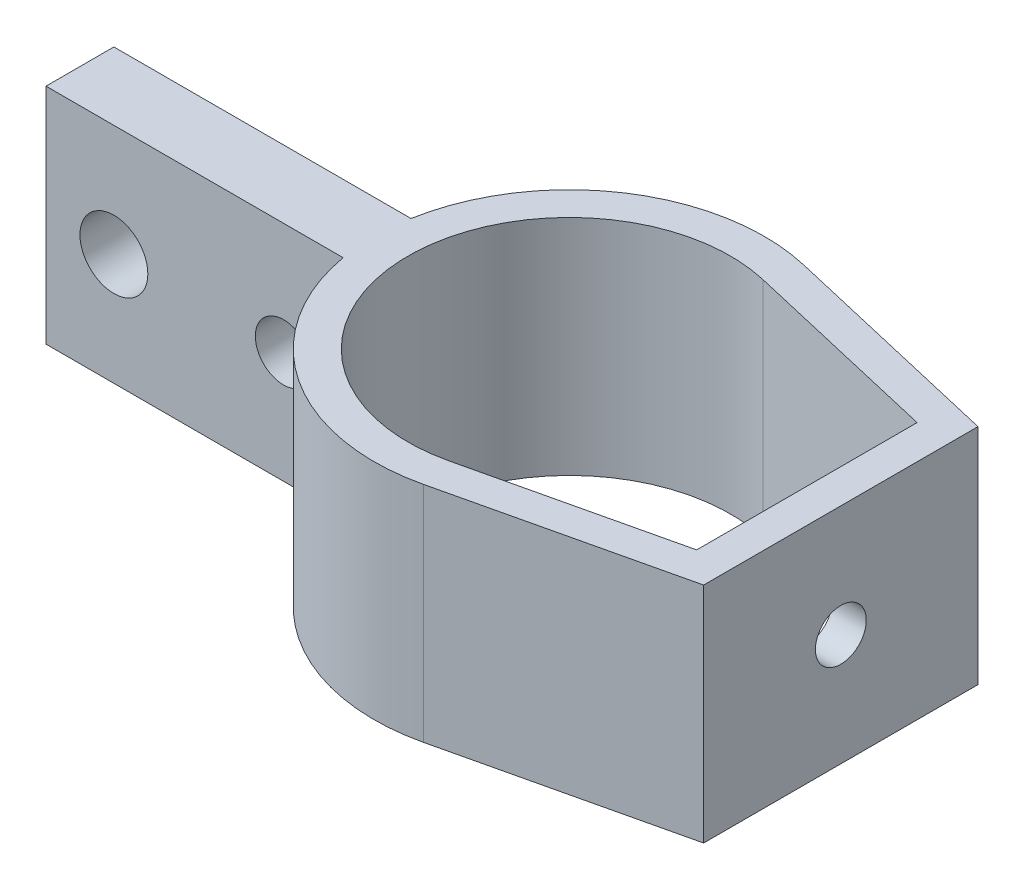
ISO-10303-21;
HEADER;
FILE_DESCRIPTION(('STEP AP214'),'2;1');
FILE_NAME('part.step','',(''),(''),'','','');
FILE_SCHEMA(('AUTOMOTIVE_DESIGN { 1 0 10303 214 1 1 1 1 }'));
ENDSEC;
DATA;
#1=APPLICATION_CONTEXT('core data for automotive mechanical design processes');
#2=APPLICATION_PROTOCOL_DEFINITION('international standard','automotive_design',2000,#1);
#3=PRODUCT_CONTEXT('',#1,'mechanical');
#4=PRODUCT('Part','Part','',(#3));
#5=PRODUCT_RELATED_PRODUCT_CATEGORY('part','',(#4));
#6=PRODUCT_DEFINITION_FORMATION('','',#4);
#7=PRODUCT_DEFINITION_CONTEXT('part definition',#1,'design');
#8=PRODUCT_DEFINITION('design','',#6,#7);
#9=PRODUCT_DEFINITION_SHAPE('','',#8);
#10=(LENGTH_UNIT() NAMED_UNIT(*) SI_UNIT(.MILLI.,.METRE.));
#11=(NAMED_UNIT(*) PLANE_ANGLE_UNIT() SI_UNIT($,.RADIAN.));
#12=(NAMED_UNIT(*) SI_UNIT($,.STERADIAN.) SOLID_ANGLE_UNIT());
#13=UNCERTAINTY_MEASURE_WITH_UNIT(LENGTH_MEASURE(1.E-05),#10,'distance_accuracy_value','');
#14=(GEOMETRIC_REPRESENTATION_CONTEXT(3) GLOBAL_UNCERTAINTY_ASSIGNED_CONTEXT((#13)) GLOBAL_UNIT_ASSIGNED_CONTEXT((#10,
#11,#12)) REPRESENTATION_CONTEXT('',''));
#15=CARTESIAN_POINT('',(0.,0.,0.));
#16=DIRECTION('',(0.,0.,1.));
#17=DIRECTION('',(1.,0.,0.));
#18=AXIS2_PLACEMENT_3D('',#15,#16,#17);
#19=CARTESIAN_POINT('',(0.,10.033,0.));
#20=DIRECTION('',(0.,1.,0.));
#21=DIRECTION('',(0.,0.,1.));
#22=AXIS2_PLACEMENT_3D('',#19,#20,#21);
#23=PLANE('',#22);
#24=DIRECTION('',(1.,0.,0.));
#25=VECTOR('',#24,1.);
#26=CARTESIAN_POINT('',(-43.942,10.033,3.048));
#27=LINE('',#26,#25);
#28=CARTESIAN_POINT('',(-43.942,10.033,3.048));
#29=VERTEX_POINT('',#28);
#30=CARTESIAN_POINT('',(-17.2589215190289,10.033,3.04799999999999));
#31=VERTEX_POINT('',#30);
#32=EDGE_CURVE('E169',#29,#31,#27,.T.);
#33=ORIENTED_EDGE('',*,*,#32,.T.);
#34=CARTESIAN_POINT('',(0.,10.033,0.));
#35=DIRECTION('',(0.,1.,0.));
#36=DIRECTION('',(0.,0.,1.));
#37=AXIS2_PLACEMENT_3D('',#34,#35,#36);
#38=CIRCLE('',#37,17.526);
#39=CARTESIAN_POINT('',(3.97304390096949,10.033,17.0697275362253));
#40=VERTEX_POINT('',#39);
#41=EDGE_CURVE('E172',#31,#40,#38,.T.);
#42=ORIENTED_EDGE('',*,*,#41,.T.);
#43=DIRECTION('',(0.973965966919167,0.,-0.226694277129379));
#44=VECTOR('',#43,1.);
#45=CARTESIAN_POINT('',(24.384,10.033,12.319));
#46=LINE('',#45,#44);
#47=CARTESIAN_POINT('',(24.384,10.033,12.319));
#48=VERTEX_POINT('',#47);
#49=EDGE_CURVE('E175',#40,#48,#46,.T.);
#50=ORIENTED_EDGE('',*,*,#49,.T.);
#51=DIRECTION('',(0.,0.,-1.));
#52=VECTOR('',#51,1.);
#53=CARTESIAN_POINT('',(24.384,10.033,12.319));
#54=LINE('',#53,#52);
#55=CARTESIAN_POINT('',(24.384,10.033,-12.319));
#56=VERTEX_POINT('',#55);
#57=EDGE_CURVE('E177',#48,#56,#54,.T.);
#58=ORIENTED_EDGE('',*,*,#57,.T.);
#59=DIRECTION('',(-0.973965966919167,0.,-0.226694277129379));
#60=VECTOR('',#59,1.);
#61=CARTESIAN_POINT('',(24.384,10.033,-12.319));
#62=LINE('',#61,#60);
#63=CARTESIAN_POINT('',(3.9730439009695,10.033,-17.0697275362253));
#64=VERTEX_POINT('',#63);
#65=EDGE_CURVE('E179',#56,#64,#62,.T.);
#66=ORIENTED_EDGE('',*,*,#65,.T.);
#67=CARTESIAN_POINT('',(0.,10.033,0.));
#68=DIRECTION('',(0.,1.,0.));
#69=DIRECTION('',(0.,0.,1.));
#70=AXIS2_PLACEMENT_3D('',#67,#68,#69);
#71=CIRCLE('',#70,17.526);
#72=CARTESIAN_POINT('',(-17.2589215190289,10.033,-3.048));
#73=VERTEX_POINT('',#72);
#74=EDGE_CURVE('E181',#64,#73,#71,.T.);
#75=ORIENTED_EDGE('',*,*,#74,.T.);
#76=DIRECTION('',(-1.,0.,0.));
#77=VECTOR('',#76,1.);
#78=CARTESIAN_POINT('',(-43.942,10.033,-3.048));
#79=LINE('',#78,#77);
#80=CARTESIAN_POINT('',(-43.942,10.033,-3.048));
#81=VERTEX_POINT('',#80);
#82=EDGE_CURVE('E183',#73,#81,#79,.T.);
#83=ORIENTED_EDGE('',*,*,#82,.T.);
#84=DIRECTION('',(0.,0.,1.));
#85=VECTOR('',#84,1.);
#86=CARTESIAN_POINT('',(-43.942,10.033,3.048));
#87=LINE('',#86,#85);
#88=EDGE_CURVE('E185',#81,#29,#87,.T.);
#89=ORIENTED_EDGE('',*,*,#88,.T.);
#90=EDGE_LOOP('',(#33,#42,#50,#58,#66,#75,#83,#89));
#91=FACE_BOUND('',#90,.T.);
#92=DIRECTION('',(0.973965966919167,0.,-0.226694277129379));
#93=VECTOR('',#92,1.);
#94=CARTESIAN_POINT('',(3.28207974427915,10.033,14.1010792690557));
#95=LINE('',#94,#93);
#96=CARTESIAN_POINT('',(3.28207974427915,10.033,14.1010792690557));
#97=VERTEX_POINT('',#96);
#98=CARTESIAN_POINT('',(21.336,10.033,9.89896077546181));
#99=VERTEX_POINT('',#98);
#100=EDGE_CURVE('E139',#97,#99,#95,.T.);
#101=ORIENTED_EDGE('',*,*,#100,.F.);
#102=CARTESIAN_POINT('',(0.,10.033,0.));
#103=DIRECTION('',(0.,1.,0.));
#104=DIRECTION('',(0.,0.,1.));
#105=AXIS2_PLACEMENT_3D('',#102,#103,#104);
#106=CIRCLE('',#105,14.478);
#107=CARTESIAN_POINT('',(3.28207974427915,10.033,-14.1010792690557));
#108=VERTEX_POINT('',#107);
#109=EDGE_CURVE('E131',#108,#97,#106,.T.);
#110=ORIENTED_EDGE('',*,*,#109,.F.);
#111=DIRECTION('',(-0.973965966919167,0.,-0.226694277129379));
#112=VECTOR('',#111,1.);
#113=CARTESIAN_POINT('',(3.28207974427915,10.033,-14.1010792690557));
#114=LINE('',#113,#112);
#115=CARTESIAN_POINT('',(21.336,10.033,-9.89896077546181));
#116=VERTEX_POINT('',#115);
#117=EDGE_CURVE('E153',#116,#108,#114,.T.);
#118=ORIENTED_EDGE('',*,*,#117,.F.);
#119=DIRECTION('',(0.,0.,-1.));
#120=VECTOR('',#119,1.);
#121=CARTESIAN_POINT('',(21.336,10.033,9.89896077546181));
#122=LINE('',#121,#120);
#123=EDGE_CURVE('E151',#99,#116,#122,.T.);
#124=ORIENTED_EDGE('',*,*,#123,.F.);
#125=EDGE_LOOP('',(#101,#110,#118,#124));
#126=FACE_BOUND('',#125,.T.);
#127=ADVANCED_FACE('F40',(#91,#126),#23,.T.);
#128=CARTESIAN_POINT('',(0.,-10.033,0.));
#129=DIRECTION('',(0.,1.,0.));
#130=DIRECTION('',(0.,0.,1.));
#131=AXIS2_PLACEMENT_3D('',#128,#129,#130);
#132=PLANE('',#131);
#133=DIRECTION('',(1.,0.,0.));
#134=VECTOR('',#133,1.);
#135=CARTESIAN_POINT('',(-43.942,-10.033,3.048));
#136=LINE('',#135,#134);
#137=CARTESIAN_POINT('',(-43.942,-10.033,3.048));
#138=VERTEX_POINT('',#137);
#139=CARTESIAN_POINT('',(-17.2589215190289,-10.033,3.04799999999999));
#140=VERTEX_POINT('',#139);
#141=EDGE_CURVE('E147',#138,#140,#136,.T.);
#142=ORIENTED_EDGE('',*,*,#141,.F.);
#143=DIRECTION('',(0.,0.,1.));
#144=VECTOR('',#143,1.);
#145=CARTESIAN_POINT('',(-43.942,-10.033,3.048));
#146=LINE('',#145,#144);
#147=CARTESIAN_POINT('',(-43.942,-10.033,-3.048));
#148=VERTEX_POINT('',#147);
#149=EDGE_CURVE('E173',#148,#138,#146,.T.);
#150=ORIENTED_EDGE('',*,*,#149,.F.);
#151=DIRECTION('',(-1.,0.,0.));
#152=VECTOR('',#151,1.);
#153=CARTESIAN_POINT('',(-43.942,-10.033,-3.048));
#154=LINE('',#153,#152);
#155=CARTESIAN_POINT('',(-17.2589215190289,-10.033,-3.048));
#156=VERTEX_POINT('',#155);
#157=EDGE_CURVE('E200',#156,#148,#154,.T.);
#158=ORIENTED_EDGE('',*,*,#157,.F.);
#159=CARTESIAN_POINT('',(0.,-10.033,0.));
#160=DIRECTION('',(0.,1.,0.));
#161=DIRECTION('',(0.,0.,1.));
#162=AXIS2_PLACEMENT_3D('',#159,#160,#161);
#163=CIRCLE('',#162,17.526);
#164=CARTESIAN_POINT('',(3.9730439009695,-10.033,-17.0697275362253));
#165=VERTEX_POINT('',#164);
#166=EDGE_CURVE('E198',#165,#156,#163,.T.);
#167=ORIENTED_EDGE('',*,*,#166,.F.);
#168=DIRECTION('',(-0.973965966919167,0.,-0.226694277129379));
#169=VECTOR('',#168,1.);
#170=CARTESIAN_POINT('',(24.384,-10.033,-12.319));
#171=LINE('',#170,#169);
#172=CARTESIAN_POINT('',(24.384,-10.033,-12.319));
#173=VERTEX_POINT('',#172);
#174=EDGE_CURVE('E196',#173,#165,#171,.T.);
#175=ORIENTED_EDGE('',*,*,#174,.F.);
#176=DIRECTION('',(0.,0.,-1.));
#177=VECTOR('',#176,1.);
#178=CARTESIAN_POINT('',(24.384,-10.033,12.319));
#179=LINE('',#178,#177);
#180=CARTESIAN_POINT('',(24.384,-10.033,12.319));
#181=VERTEX_POINT('',#180);
#182=EDGE_CURVE('E194',#181,#173,#179,.T.);
#183=ORIENTED_EDGE('',*,*,#182,.F.);
#184=DIRECTION('',(0.973965966919167,0.,-0.226694277129379));
#185=VECTOR('',#184,1.);
#186=CARTESIAN_POINT('',(24.384,-10.033,12.319));
#187=LINE('',#186,#185);
#188=CARTESIAN_POINT('',(3.97304390096949,-10.033,17.0697275362253));
#189=VERTEX_POINT('',#188);
#190=EDGE_CURVE('E192',#189,#181,#187,.T.);
#191=ORIENTED_EDGE('',*,*,#190,.F.);
#192=CARTESIAN_POINT('',(0.,-10.033,0.));
#193=DIRECTION('',(0.,1.,0.));
#194=DIRECTION('',(0.,0.,1.));
#195=AXIS2_PLACEMENT_3D('',#192,#193,#194);
#196=CIRCLE('',#195,17.526);
#197=EDGE_CURVE('E190',#140,#189,#196,.T.);
#198=ORIENTED_EDGE('',*,*,#197,.F.);
#199=EDGE_LOOP('',(#142,#150,#158,#167,#175,#183,#191,#198));
#200=FACE_BOUND('',#199,.T.);
#201=CARTESIAN_POINT('',(0.,-10.033,0.));
#202=DIRECTION('',(0.,1.,0.));
#203=DIRECTION('',(0.,0.,1.));
#204=AXIS2_PLACEMENT_3D('',#201,#202,#203);
#205=CIRCLE('',#204,14.478);
#206=CARTESIAN_POINT('',(3.28207974427915,-10.033,-14.1010792690557));
#207=VERTEX_POINT('',#206);
#208=CARTESIAN_POINT('',(3.28207974427915,-10.033,14.1010792690557));
#209=VERTEX_POINT('',#208);
#210=EDGE_CURVE('E65',#207,#209,#205,.T.);
#211=ORIENTED_EDGE('',*,*,#210,.T.);
#212=DIRECTION('',(0.973965966919167,0.,-0.226694277129379));
#213=VECTOR('',#212,1.);
#214=CARTESIAN_POINT('',(3.28207974427915,-10.033,14.1010792690557));
#215=LINE('',#214,#213);
#216=CARTESIAN_POINT('',(21.336,-10.033,9.89896077546181));
#217=VERTEX_POINT('',#216);
#218=EDGE_CURVE('E146',#209,#217,#215,.T.);
#219=ORIENTED_EDGE('',*,*,#218,.T.);
#220=DIRECTION('',(0.,0.,-1.));
#221=VECTOR('',#220,1.);
#222=CARTESIAN_POINT('',(21.336,-10.033,9.89896077546181));
#223=LINE('',#222,#221);
#224=CARTESIAN_POINT('',(21.336,-10.033,-9.89896077546181));
#225=VERTEX_POINT('',#224);
#226=EDGE_CURVE('E161',#217,#225,#223,.T.);
#227=ORIENTED_EDGE('',*,*,#226,.T.);
#228=DIRECTION('',(-0.973965966919167,0.,-0.226694277129379));
#229=VECTOR('',#228,1.);
#230=CARTESIAN_POINT('',(3.28207974427915,-10.033,-14.1010792690557));
#231=LINE('',#230,#229);
#232=EDGE_CURVE('E140',#225,#207,#231,.T.);
#233=ORIENTED_EDGE('',*,*,#232,.T.);
#234=EDGE_LOOP('',(#211,#219,#227,#233));
#235=FACE_BOUND('',#234,.T.);
#236=ADVANCED_FACE('F252',(#200,#235),#132,.F.);
#237=CARTESIAN_POINT('',(-43.942,10.033,3.048));
#238=DIRECTION('',(0.,0.,-1.));
#239=DIRECTION('',(-1.,0.,0.));
#240=AXIS2_PLACEMENT_3D('',#237,#238,#239);
#241=PLANE('',#240);
#242=CARTESIAN_POINT('',(-37.846,0.,3.048));
#243=DIRECTION('',(0.,0.,-1.));
#244=DIRECTION('',(-1.,0.,0.));
#245=AXIS2_PLACEMENT_3D('',#242,#243,#244);
#246=CIRCLE('',#245,3.048);
#247=CARTESIAN_POINT('',(-40.894,0.,3.048));
#248=VERTEX_POINT('',#247);
#249=EDGE_CURVE('E159',#248,#248,#246,.T.);
#250=ORIENTED_EDGE('',*,*,#249,.T.);
#251=EDGE_LOOP('',(#250));
#252=FACE_BOUND('',#251,.T.);
#253=CARTESIAN_POINT('',(-22.606,0.,3.048));
#254=DIRECTION('',(0.,0.,-1.));
#255=DIRECTION('',(-1.,0.,0.));
#256=AXIS2_PLACEMENT_3D('',#253,#254,#255);
#257=CIRCLE('',#256,2.54);
#258=CARTESIAN_POINT('',(-25.146,0.,3.048));
#259=VERTEX_POINT('',#258);
#260=EDGE_CURVE('E224',#259,#259,#257,.T.);
#261=ORIENTED_EDGE('',*,*,#260,.T.);
#262=EDGE_LOOP('',(#261));
#263=FACE_BOUND('',#262,.T.);
#264=ORIENTED_EDGE('',*,*,#141,.T.);
#265=DIRECTION('',(0.,-1.,0.));
#266=VECTOR('',#265,1.);
#267=CARTESIAN_POINT('',(-17.2589215190289,10.033,3.04799999999999));
#268=LINE('',#267,#266);
#269=EDGE_CURVE('E11',#31,#140,#268,.T.);
#270=ORIENTED_EDGE('',*,*,#269,.F.);
#271=ORIENTED_EDGE('',*,*,#32,.F.);
#272=DIRECTION('',(0.,-1.,0.));
#273=VECTOR('',#272,1.);
#274=CARTESIAN_POINT('',(-43.942,10.033,3.048));
#275=LINE('',#274,#273);
#276=EDGE_CURVE('E187',#29,#138,#275,.T.);
#277=ORIENTED_EDGE('',*,*,#276,.T.);
#278=EDGE_LOOP('',(#264,#270,#271,#277));
#279=FACE_BOUND('',#278,.T.);
#280=ADVANCED_FACE('F42',(#252,#263,#279),#241,.F.);
#281=CARTESIAN_POINT('',(0.,10.033,0.));
#282=DIRECTION('',(0.,-1.,0.));
#283=DIRECTION('',(0.,0.,-1.));
#284=AXIS2_PLACEMENT_3D('',#281,#282,#283);
#285=CYLINDRICAL_SURFACE('',#284,17.526);
#286=ORIENTED_EDGE('',*,*,#197,.T.);
#287=DIRECTION('',(0.,-1.,0.));
#288=VECTOR('',#287,1.);
#289=CARTESIAN_POINT('',(3.97304390096949,10.033,17.0697275362253));
#290=LINE('',#289,#288);
#291=EDGE_CURVE('E49',#40,#189,#290,.T.);
#292=ORIENTED_EDGE('',*,*,#291,.F.);
#293=ORIENTED_EDGE('',*,*,#41,.F.);
#294=ORIENTED_EDGE('',*,*,#269,.T.);
#295=EDGE_LOOP('',(#286,#292,#293,#294));
#296=FACE_BOUND('',#295,.T.);
#297=ADVANCED_FACE('F293',(#296),#285,.T.);
#298=CARTESIAN_POINT('',(24.384,10.033,12.319));
#299=DIRECTION('',(-0.226694277129379,0.,-0.973965966919167));
#300=DIRECTION('',(-0.973965966919167,0.,0.226694277129379));
#301=AXIS2_PLACEMENT_3D('',#298,#299,#300);
#302=PLANE('',#301);
#303=ORIENTED_EDGE('',*,*,#190,.T.);
#304=DIRECTION('',(0.,-1.,0.));
#305=VECTOR('',#304,1.);
#306=CARTESIAN_POINT('',(24.384,10.033,12.319));
#307=LINE('',#306,#305);
#308=EDGE_CURVE('E217',#48,#181,#307,.T.);
#309=ORIENTED_EDGE('',*,*,#308,.F.);
#310=ORIENTED_EDGE('',*,*,#49,.F.);
#311=ORIENTED_EDGE('',*,*,#291,.T.);
#312=EDGE_LOOP('',(#303,#309,#310,#311));
#313=FACE_BOUND('',#312,.T.);
#314=ADVANCED_FACE('F291',(#313),#302,.F.);
#315=CARTESIAN_POINT('',(24.384,10.033,12.319));
#316=DIRECTION('',(-1.,0.,0.));
#317=DIRECTION('',(0.,0.,1.));
#318=AXIS2_PLACEMENT_3D('',#315,#316,#317);
#319=PLANE('',#318);
#320=CARTESIAN_POINT('',(24.384,0.,0.));
#321=DIRECTION('',(-1.,0.,0.));
#322=DIRECTION('',(0.,0.,1.));
#323=AXIS2_PLACEMENT_3D('',#320,#321,#322);
#324=CIRCLE('',#323,2.286);
#325=CARTESIAN_POINT('',(24.384,0.,2.286));
#326=VERTEX_POINT('',#325);
#327=EDGE_CURVE('E225',#326,#326,#324,.T.);
#328=ORIENTED_EDGE('',*,*,#327,.T.);
#329=EDGE_LOOP('',(#328));
#330=FACE_BOUND('',#329,.T.);
#331=ORIENTED_EDGE('',*,*,#182,.T.);
#332=DIRECTION('',(0.,-1.,0.));
#333=VECTOR('',#332,1.);
#334=CARTESIAN_POINT('',(24.384,10.033,-12.319));
#335=LINE('',#334,#333);
#336=EDGE_CURVE('E214',#56,#173,#335,.T.);
#337=ORIENTED_EDGE('',*,*,#336,.F.);
#338=ORIENTED_EDGE('',*,*,#57,.F.);
#339=ORIENTED_EDGE('',*,*,#308,.T.);
#340=EDGE_LOOP('',(#331,#337,#338,#339));
#341=FACE_BOUND('',#340,.T.);
#342=ADVANCED_FACE('F287',(#330,#341),#319,.F.);
#343=CARTESIAN_POINT('',(24.384,10.033,-12.319));
#344=DIRECTION('',(-0.226694277129379,0.,0.973965966919167));
#345=DIRECTION('',(0.973965966919167,0.,0.226694277129379));
#346=AXIS2_PLACEMENT_3D('',#343,#344,#345);
#347=PLANE('',#346);
#348=ORIENTED_EDGE('',*,*,#174,.T.);
#349=DIRECTION('',(0.,-1.,0.));
#350=VECTOR('',#349,1.);
#351=CARTESIAN_POINT('',(3.9730439009695,10.033,-17.0697275362253));
#352=LINE('',#351,#350);
#353=EDGE_CURVE('E211',#64,#165,#352,.T.);
#354=ORIENTED_EDGE('',*,*,#353,.F.);
#355=ORIENTED_EDGE('',*,*,#65,.F.);
#356=ORIENTED_EDGE('',*,*,#336,.T.);
#357=EDGE_LOOP('',(#348,#354,#355,#356));
#358=FACE_BOUND('',#357,.T.);
#359=ADVANCED_FACE('F283',(#358),#347,.F.);
#360=CARTESIAN_POINT('',(0.,10.033,0.));
#361=DIRECTION('',(0.,-1.,0.));
#362=DIRECTION('',(0.,0.,-1.));
#363=AXIS2_PLACEMENT_3D('',#360,#361,#362);
#364=CYLINDRICAL_SURFACE('',#363,17.526);
#365=ORIENTED_EDGE('',*,*,#166,.T.);
#366=DIRECTION('',(0.,-1.,0.));
#367=VECTOR('',#366,1.);
#368=CARTESIAN_POINT('',(-17.2589215190289,10.033,-3.048));
#369=LINE('',#368,#367);
#370=EDGE_CURVE('E208',#73,#156,#369,.T.);
#371=ORIENTED_EDGE('',*,*,#370,.F.);
#372=ORIENTED_EDGE('',*,*,#74,.F.);
#373=ORIENTED_EDGE('',*,*,#353,.T.);
#374=EDGE_LOOP('',(#365,#371,#372,#373));
#375=FACE_BOUND('',#374,.T.);
#376=ADVANCED_FACE('F280',(#375),#364,.T.);
#377=CARTESIAN_POINT('',(-43.942,10.033,-3.048));
#378=DIRECTION('',(0.,0.,1.));
#379=DIRECTION('',(1.,0.,0.));
#380=AXIS2_PLACEMENT_3D('',#377,#378,#379);
#381=PLANE('',#380);
#382=CARTESIAN_POINT('',(-37.846,0.,-3.048));
#383=DIRECTION('',(0.,0.,1.));
#384=DIRECTION('',(1.,0.,0.));
#385=AXIS2_PLACEMENT_3D('',#382,#383,#384);
#386=CIRCLE('',#385,3.048);
#387=CARTESIAN_POINT('',(-34.798,0.,-3.048));
#388=VERTEX_POINT('',#387);
#389=EDGE_CURVE('E226',#388,#388,#386,.T.);
#390=ORIENTED_EDGE('',*,*,#389,.T.);
#391=EDGE_LOOP('',(#390));
#392=FACE_BOUND('',#391,.T.);
#393=CARTESIAN_POINT('',(-22.606,0.,-3.048));
#394=DIRECTION('',(0.,0.,1.));
#395=DIRECTION('',(1.,0.,0.));
#396=AXIS2_PLACEMENT_3D('',#393,#394,#395);
#397=CIRCLE('',#396,2.54);
#398=CARTESIAN_POINT('',(-20.066,0.,-3.048));
#399=VERTEX_POINT('',#398);
#400=EDGE_CURVE('E222',#399,#399,#397,.T.);
#401=ORIENTED_EDGE('',*,*,#400,.T.);
#402=EDGE_LOOP('',(#401));
#403=FACE_BOUND('',#402,.T.);
#404=ORIENTED_EDGE('',*,*,#157,.T.);
#405=DIRECTION('',(0.,-1.,0.));
#406=VECTOR('',#405,1.);
#407=CARTESIAN_POINT('',(-43.942,10.033,-3.048));
#408=LINE('',#407,#406);
#409=EDGE_CURVE('E205',#81,#148,#408,.T.);
#410=ORIENTED_EDGE('',*,*,#409,.F.);
#411=ORIENTED_EDGE('',*,*,#82,.F.);
#412=ORIENTED_EDGE('',*,*,#370,.T.);
#413=EDGE_LOOP('',(#404,#410,#411,#412));
#414=FACE_BOUND('',#413,.T.);
#415=ADVANCED_FACE('F276',(#392,#403,#414),#381,.F.);
#416=CARTESIAN_POINT('',(-43.942,10.033,3.048));
#417=DIRECTION('',(1.,0.,0.));
#418=DIRECTION('',(0.,0.,-1.));
#419=AXIS2_PLACEMENT_3D('',#416,#417,#418);
#420=PLANE('',#419);
#421=ORIENTED_EDGE('',*,*,#149,.T.);
#422=ORIENTED_EDGE('',*,*,#276,.F.);
#423=ORIENTED_EDGE('',*,*,#88,.F.);
#424=ORIENTED_EDGE('',*,*,#409,.T.);
#425=EDGE_LOOP('',(#421,#422,#423,#424));
#426=FACE_BOUND('',#425,.T.);
#427=ADVANCED_FACE('F273',(#426),#420,.F.);
#428=CARTESIAN_POINT('',(0.,10.033,0.));
#429=DIRECTION('',(0.,-1.,0.));
#430=DIRECTION('',(0.,0.,-1.));
#431=AXIS2_PLACEMENT_3D('',#428,#429,#430);
#432=CYLINDRICAL_SURFACE('',#431,14.478);
#433=ORIENTED_EDGE('',*,*,#210,.F.);
#434=DIRECTION('',(0.,-1.,0.));
#435=VECTOR('',#434,1.);
#436=CARTESIAN_POINT('',(3.28207974427915,10.033,-14.1010792690557));
#437=LINE('',#436,#435);
#438=EDGE_CURVE('E135',#108,#207,#437,.T.);
#439=ORIENTED_EDGE('',*,*,#438,.F.);
#440=ORIENTED_EDGE('',*,*,#109,.T.);
#441=DIRECTION('',(0.,-1.,0.));
#442=VECTOR('',#441,1.);
#443=CARTESIAN_POINT('',(3.28207974427915,10.033,14.1010792690557));
#444=LINE('',#443,#442);
#445=EDGE_CURVE('E134',#97,#209,#444,.T.);
#446=ORIENTED_EDGE('',*,*,#445,.T.);
#447=EDGE_LOOP('',(#433,#439,#440,#446));
#448=FACE_BOUND('',#447,.T.);
#449=ADVANCED_FACE('F133',(#448),#432,.F.);
#450=CARTESIAN_POINT('',(3.28207974427915,10.033,14.1010792690557));
#451=DIRECTION('',(-0.226694277129379,0.,-0.973965966919167));
#452=DIRECTION('',(-0.973965966919167,0.,0.226694277129379));
#453=AXIS2_PLACEMENT_3D('',#450,#451,#452);
#454=PLANE('',#453);
#455=ORIENTED_EDGE('',*,*,#218,.F.);
#456=ORIENTED_EDGE('',*,*,#445,.F.);
#457=ORIENTED_EDGE('',*,*,#100,.T.);
#458=DIRECTION('',(0.,-1.,0.));
#459=VECTOR('',#458,1.);
#460=CARTESIAN_POINT('',(21.336,10.033,9.89896077546181));
#461=LINE('',#460,#459);
#462=EDGE_CURVE('E148',#99,#217,#461,.T.);
#463=ORIENTED_EDGE('',*,*,#462,.T.);
#464=EDGE_LOOP('',(#455,#456,#457,#463));
#465=FACE_BOUND('',#464,.T.);
#466=ADVANCED_FACE('F143',(#465),#454,.T.);
#467=CARTESIAN_POINT('',(21.336,10.033,9.89896077546181));
#468=DIRECTION('',(-1.,0.,0.));
#469=DIRECTION('',(0.,0.,1.));
#470=AXIS2_PLACEMENT_3D('',#467,#468,#469);
#471=PLANE('',#470);
#472=CARTESIAN_POINT('',(21.336,0.,0.));
#473=DIRECTION('',(-1.,0.,0.));
#474=DIRECTION('',(0.,0.,1.));
#475=AXIS2_PLACEMENT_3D('',#472,#473,#474);
#476=CIRCLE('',#475,2.286);
#477=CARTESIAN_POINT('',(21.336,0.,2.286));
#478=VERTEX_POINT('',#477);
#479=EDGE_CURVE('E44',#478,#478,#476,.T.);
#480=ORIENTED_EDGE('',*,*,#479,.F.);
#481=EDGE_LOOP('',(#480));
#482=FACE_BOUND('',#481,.T.);
#483=ORIENTED_EDGE('',*,*,#226,.F.);
#484=ORIENTED_EDGE('',*,*,#462,.F.);
#485=ORIENTED_EDGE('',*,*,#123,.T.);
#486=DIRECTION('',(0.,-1.,0.));
#487=VECTOR('',#486,1.);
#488=CARTESIAN_POINT('',(21.336,10.033,-9.89896077546181));
#489=LINE('',#488,#487);
#490=EDGE_CURVE('E57',#116,#225,#489,.T.);
#491=ORIENTED_EDGE('',*,*,#490,.T.);
#492=EDGE_LOOP('',(#483,#484,#485,#491));
#493=FACE_BOUND('',#492,.T.);
#494=ADVANCED_FACE('F245',(#482,#493),#471,.T.);
#495=CARTESIAN_POINT('',(3.28207974427915,10.033,-14.1010792690557));
#496=DIRECTION('',(-0.226694277129379,0.,0.973965966919167));
#497=DIRECTION('',(0.973965966919167,0.,0.226694277129379));
#498=AXIS2_PLACEMENT_3D('',#495,#496,#497);
#499=PLANE('',#498);
#500=ORIENTED_EDGE('',*,*,#232,.F.);
#501=ORIENTED_EDGE('',*,*,#490,.F.);
#502=ORIENTED_EDGE('',*,*,#117,.T.);
#503=ORIENTED_EDGE('',*,*,#438,.T.);
#504=EDGE_LOOP('',(#500,#501,#502,#503));
#505=FACE_BOUND('',#504,.T.);
#506=ADVANCED_FACE('F248',(#505),#499,.T.);
#507=CARTESIAN_POINT('',(-22.606,0.,-6.98500000000001));
#508=DIRECTION('',(0.,0.,1.));
#509=DIRECTION('',(1.,0.,0.));
#510=AXIS2_PLACEMENT_3D('',#507,#508,#509);
#511=CYLINDRICAL_SURFACE('',#510,2.54);
#512=ORIENTED_EDGE('',*,*,#400,.F.);
#513=EDGE_LOOP('',(#512));
#514=FACE_BOUND('',#513,.T.);
#515=ORIENTED_EDGE('',*,*,#260,.F.);
#516=EDGE_LOOP('',(#515));
#517=FACE_BOUND('',#516,.T.);
#518=ADVANCED_FACE('F254',(#514,#517),#511,.F.);
#519=CARTESIAN_POINT('',(-37.846,0.,-6.98500000000001));
#520=DIRECTION('',(0.,0.,1.));
#521=DIRECTION('',(1.,0.,0.));
#522=AXIS2_PLACEMENT_3D('',#519,#520,#521);
#523=CYLINDRICAL_SURFACE('',#522,3.048);
#524=ORIENTED_EDGE('',*,*,#389,.F.);
#525=EDGE_LOOP('',(#524));
#526=FACE_BOUND('',#525,.T.);
#527=ORIENTED_EDGE('',*,*,#249,.F.);
#528=EDGE_LOOP('',(#527));
#529=FACE_BOUND('',#528,.T.);
#530=ADVANCED_FACE('F259',(#526,#529),#523,.F.);
#531=CARTESIAN_POINT('',(14.351,0.,0.));
#532=DIRECTION('',(1.,0.,0.));
#533=DIRECTION('',(0.,0.,-1.));
#534=AXIS2_PLACEMENT_3D('',#531,#532,#533);
#535=CYLINDRICAL_SURFACE('',#534,2.286);
#536=ORIENTED_EDGE('',*,*,#479,.T.);
#537=EDGE_LOOP('',(#536));
#538=FACE_BOUND('',#537,.T.);
#539=ORIENTED_EDGE('',*,*,#327,.F.);
#540=EDGE_LOOP('',(#539));
#541=FACE_BOUND('',#540,.T.);
#542=ADVANCED_FACE('F242',(#538,#541),#535,.F.);
#543=CLOSED_SHELL('',(#127,#236,#280,#297,#314,#342,#359,#376,#415,#427,#449,#466,#494,#506,
#518,#530,#542));
#544=MANIFOLD_SOLID_BREP('B2',#543);
#545=ADVANCED_BREP_SHAPE_REPRESENTATION('',(#18,#544),#14);
#546=SHAPE_DEFINITION_REPRESENTATION(#9,#545);
ENDSEC;
END-ISO-10303-21;
